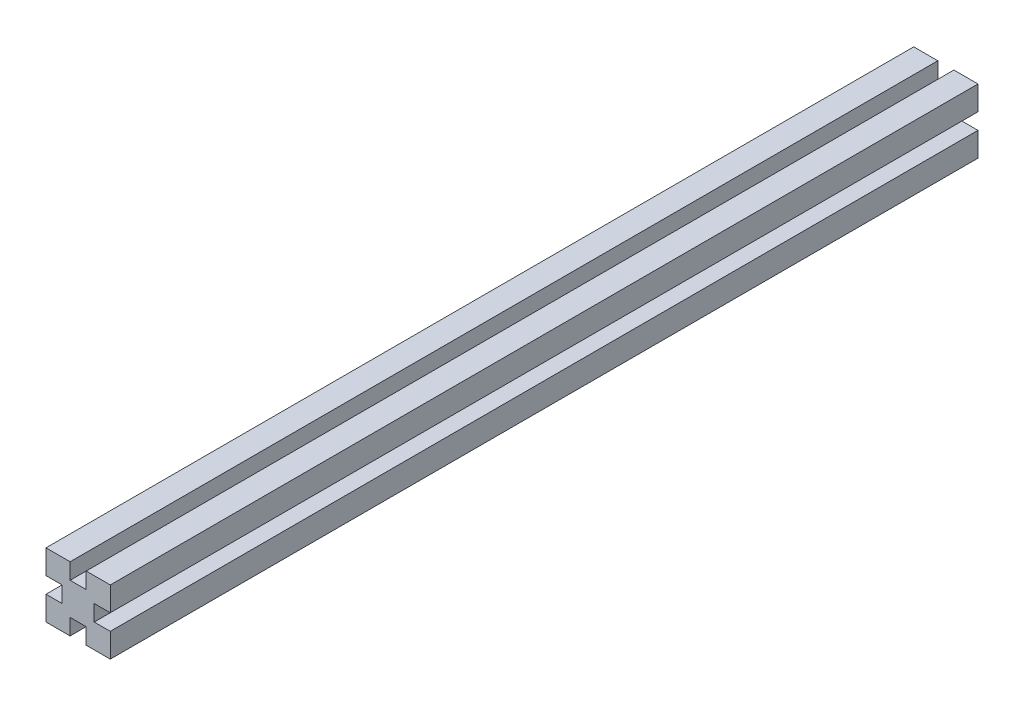
ISO-10303-21;
HEADER;
FILE_DESCRIPTION(('STEP AP214'),'2;1');
FILE_NAME('part.step','',(''),(''),'','','');
FILE_SCHEMA(('AUTOMOTIVE_DESIGN { 1 0 10303 214 1 1 1 1 }'));
ENDSEC;
DATA;
#1=APPLICATION_CONTEXT('core data for automotive mechanical design processes');
#2=APPLICATION_PROTOCOL_DEFINITION('international standard','automotive_design',2000,#1);
#3=PRODUCT_CONTEXT('',#1,'mechanical');
#4=PRODUCT('Part','Part','',(#3));
#5=PRODUCT_RELATED_PRODUCT_CATEGORY('part','',(#4));
#6=PRODUCT_DEFINITION_FORMATION('','',#4);
#7=PRODUCT_DEFINITION_CONTEXT('part definition',#1,'design');
#8=PRODUCT_DEFINITION('design','',#6,#7);
#9=PRODUCT_DEFINITION_SHAPE('','',#8);
#10=(LENGTH_UNIT() NAMED_UNIT(*) SI_UNIT(.MILLI.,.METRE.));
#11=(NAMED_UNIT(*) PLANE_ANGLE_UNIT() SI_UNIT($,.RADIAN.));
#12=(NAMED_UNIT(*) SI_UNIT($,.STERADIAN.) SOLID_ANGLE_UNIT());
#13=UNCERTAINTY_MEASURE_WITH_UNIT(LENGTH_MEASURE(1.E-05),#10,'distance_accuracy_value','');
#14=(GEOMETRIC_REPRESENTATION_CONTEXT(3) GLOBAL_UNCERTAINTY_ASSIGNED_CONTEXT((#13)) GLOBAL_UNIT_ASSIGNED_CONTEXT((#10,
#11,#12)) REPRESENTATION_CONTEXT('',''));
#15=CARTESIAN_POINT('',(0.,0.,0.));
#16=DIRECTION('',(0.,0.,1.));
#17=DIRECTION('',(1.,0.,0.));
#18=AXIS2_PLACEMENT_3D('',#15,#16,#17);
#19=CARTESIAN_POINT('',(0.,0.,-270.));
#20=DIRECTION('',(0.,0.,1.));
#21=DIRECTION('',(1.,0.,0.));
#22=AXIS2_PLACEMENT_3D('',#19,#20,#21);
#23=PLANE('',#22);
#24=DIRECTION('',(-1.,0.,0.));
#25=VECTOR('',#24,1.);
#26=CARTESIAN_POINT('',(0.,-2.5,-270.));
#27=LINE('',#26,#25);
#28=CARTESIAN_POINT('',(10.,-2.50000000000004,-270.));
#29=VERTEX_POINT('',#28);
#30=CARTESIAN_POINT('',(4.99999999999999,-2.50000000000002,-270.));
#31=VERTEX_POINT('',#30);
#32=EDGE_CURVE('E181',#29,#31,#27,.T.);
#33=ORIENTED_EDGE('',*,*,#32,.F.);
#34=DIRECTION('',(0.,-1.,0.));
#35=VECTOR('',#34,1.);
#36=CARTESIAN_POINT('',(10.,0.,-270.));
#37=LINE('',#36,#35);
#38=CARTESIAN_POINT('',(10.,-10.,-270.));
#39=VERTEX_POINT('',#38);
#40=EDGE_CURVE('E279',#29,#39,#37,.T.);
#41=ORIENTED_EDGE('',*,*,#40,.T.);
#42=DIRECTION('',(1.,0.,0.));
#43=VECTOR('',#42,1.);
#44=CARTESIAN_POINT('',(0.,-10.,-270.));
#45=LINE('',#44,#43);
#46=CARTESIAN_POINT('',(2.5,-10.,-270.));
#47=VERTEX_POINT('',#46);
#48=EDGE_CURVE('E275',#47,#39,#45,.T.);
#49=ORIENTED_EDGE('',*,*,#48,.F.);
#50=DIRECTION('',(0.,1.,0.));
#51=VECTOR('',#50,1.);
#52=CARTESIAN_POINT('',(2.5,0.,-270.));
#53=LINE('',#52,#51);
#54=CARTESIAN_POINT('',(2.5,-5.,-270.));
#55=VERTEX_POINT('',#54);
#56=EDGE_CURVE('E60',#47,#55,#53,.T.);
#57=ORIENTED_EDGE('',*,*,#56,.T.);
#58=DIRECTION('',(-1.,0.,0.));
#59=VECTOR('',#58,1.);
#60=CARTESIAN_POINT('',(0.,-5.,-270.));
#61=LINE('',#60,#59);
#62=CARTESIAN_POINT('',(-2.5,-5.,-270.));
#63=VERTEX_POINT('',#62);
#64=EDGE_CURVE('E241',#55,#63,#61,.T.);
#65=ORIENTED_EDGE('',*,*,#64,.T.);
#66=DIRECTION('',(0.,1.,0.));
#67=VECTOR('',#66,1.);
#68=CARTESIAN_POINT('',(-2.5,0.,-270.));
#69=LINE('',#68,#67);
#70=CARTESIAN_POINT('',(-2.5,-10.,-270.));
#71=VERTEX_POINT('',#70);
#72=EDGE_CURVE('E234',#71,#63,#69,.T.);
#73=ORIENTED_EDGE('',*,*,#72,.F.);
#74=CARTESIAN_POINT('',(-10.,-10.,-270.));
#75=VERTEX_POINT('',#74);
#76=EDGE_CURVE('E276',#75,#71,#45,.T.);
#77=ORIENTED_EDGE('',*,*,#76,.F.);
#78=DIRECTION('',(0.,-1.,0.));
#79=VECTOR('',#78,1.);
#80=CARTESIAN_POINT('',(-10.,0.,-270.));
#81=LINE('',#80,#79);
#82=CARTESIAN_POINT('',(-10.,-2.49999999999989,-270.));
#83=VERTEX_POINT('',#82);
#84=EDGE_CURVE('E270',#83,#75,#81,.T.);
#85=ORIENTED_EDGE('',*,*,#84,.F.);
#86=DIRECTION('',(1.,0.,0.));
#87=VECTOR('',#86,1.);
#88=CARTESIAN_POINT('',(0.,-2.5,-270.));
#89=LINE('',#88,#87);
#90=CARTESIAN_POINT('',(-5.00000000000002,-2.49999999999995,-270.));
#91=VERTEX_POINT('',#90);
#92=EDGE_CURVE('E184',#83,#91,#89,.T.);
#93=ORIENTED_EDGE('',*,*,#92,.T.);
#94=DIRECTION('',(0.,1.,0.));
#95=VECTOR('',#94,1.);
#96=CARTESIAN_POINT('',(-5.,0.,-270.));
#97=LINE('',#96,#95);
#98=CARTESIAN_POINT('',(-4.99999999999997,2.50000000000005,-270.));
#99=VERTEX_POINT('',#98);
#100=EDGE_CURVE('E238',#91,#99,#97,.T.);
#101=ORIENTED_EDGE('',*,*,#100,.T.);
#102=DIRECTION('',(1.,0.,0.));
#103=VECTOR('',#102,1.);
#104=CARTESIAN_POINT('',(0.,2.5,-270.));
#105=LINE('',#104,#103);
#106=CARTESIAN_POINT('',(-10.,2.50000000000011,-270.));
#107=VERTEX_POINT('',#106);
#108=EDGE_CURVE('E231',#107,#99,#105,.T.);
#109=ORIENTED_EDGE('',*,*,#108,.F.);
#110=CARTESIAN_POINT('',(-10.,10.,-270.));
#111=VERTEX_POINT('',#110);
#112=EDGE_CURVE('E272',#111,#107,#81,.T.);
#113=ORIENTED_EDGE('',*,*,#112,.F.);
#114=DIRECTION('',(1.,0.,0.));
#115=VECTOR('',#114,1.);
#116=CARTESIAN_POINT('',(0.,10.,-270.));
#117=LINE('',#116,#115);
#118=CARTESIAN_POINT('',(-2.5,10.,-270.));
#119=VERTEX_POINT('',#118);
#120=EDGE_CURVE('E267',#111,#119,#117,.T.);
#121=ORIENTED_EDGE('',*,*,#120,.T.);
#122=DIRECTION('',(0.,-1.,0.));
#123=VECTOR('',#122,1.);
#124=CARTESIAN_POINT('',(-2.5,0.,-270.));
#125=LINE('',#124,#123);
#126=CARTESIAN_POINT('',(-2.5,5.,-270.));
#127=VERTEX_POINT('',#126);
#128=EDGE_CURVE('E253',#119,#127,#125,.T.);
#129=ORIENTED_EDGE('',*,*,#128,.T.);
#130=DIRECTION('',(1.,0.,0.));
#131=VECTOR('',#130,1.);
#132=CARTESIAN_POINT('',(0.,5.,-270.));
#133=LINE('',#132,#131);
#134=CARTESIAN_POINT('',(2.5,5.,-270.));
#135=VERTEX_POINT('',#134);
#136=EDGE_CURVE('E259',#127,#135,#133,.T.);
#137=ORIENTED_EDGE('',*,*,#136,.T.);
#138=DIRECTION('',(0.,-1.,0.));
#139=VECTOR('',#138,1.);
#140=CARTESIAN_POINT('',(2.5,0.,-270.));
#141=LINE('',#140,#139);
#142=CARTESIAN_POINT('',(2.5,10.,-270.));
#143=VERTEX_POINT('',#142);
#144=EDGE_CURVE('E262',#143,#135,#141,.T.);
#145=ORIENTED_EDGE('',*,*,#144,.F.);
#146=CARTESIAN_POINT('',(10.,10.,-270.));
#147=VERTEX_POINT('',#146);
#148=EDGE_CURVE('E271',#143,#147,#117,.T.);
#149=ORIENTED_EDGE('',*,*,#148,.T.);
#150=CARTESIAN_POINT('',(10.,2.49999999999996,-270.));
#151=VERTEX_POINT('',#150);
#152=EDGE_CURVE('E280',#147,#151,#37,.T.);
#153=ORIENTED_EDGE('',*,*,#152,.T.);
#154=DIRECTION('',(-1.,0.,0.));
#155=VECTOR('',#154,1.);
#156=CARTESIAN_POINT('',(0.,2.5,-270.));
#157=LINE('',#156,#155);
#158=CARTESIAN_POINT('',(5.00000000000001,2.49999999999998,-270.));
#159=VERTEX_POINT('',#158);
#160=EDGE_CURVE('E52',#151,#159,#157,.T.);
#161=ORIENTED_EDGE('',*,*,#160,.T.);
#162=DIRECTION('',(0.,-1.,0.));
#163=VECTOR('',#162,1.);
#164=CARTESIAN_POINT('',(5.,0.,-270.));
#165=LINE('',#164,#163);
#166=EDGE_CURVE('E244',#159,#31,#165,.T.);
#167=ORIENTED_EDGE('',*,*,#166,.T.);
#168=EDGE_LOOP('',(#33,#41,#49,#57,#65,#73,#77,#85,#93,#101,#109,#113,#121,#129,#137,#145,#149,
#153,#161,#167));
#169=FACE_BOUND('',#168,.T.);
#170=ADVANCED_FACE('F37',(#169),#23,.F.);
#171=CARTESIAN_POINT('',(0.,0.,0.));
#172=DIRECTION('',(0.,0.,1.));
#173=DIRECTION('',(1.,0.,0.));
#174=AXIS2_PLACEMENT_3D('',#171,#172,#173);
#175=PLANE('',#174);
#176=DIRECTION('',(0.,-1.,0.));
#177=VECTOR('',#176,1.);
#178=CARTESIAN_POINT('',(10.,0.,0.));
#179=LINE('',#178,#177);
#180=CARTESIAN_POINT('',(10.,-2.50000000000004,0.));
#181=VERTEX_POINT('',#180);
#182=CARTESIAN_POINT('',(10.,-10.,0.));
#183=VERTEX_POINT('',#182);
#184=EDGE_CURVE('E198',#181,#183,#179,.T.);
#185=ORIENTED_EDGE('',*,*,#184,.F.);
#186=DIRECTION('',(-1.,0.,0.));
#187=VECTOR('',#186,1.);
#188=CARTESIAN_POINT('',(15.,-2.50000000000005,0.));
#189=LINE('',#188,#187);
#190=CARTESIAN_POINT('',(4.99999999999999,-2.50000000000002,0.));
#191=VERTEX_POINT('',#190);
#192=EDGE_CURVE('E178',#181,#191,#189,.T.);
#193=ORIENTED_EDGE('',*,*,#192,.T.);
#194=DIRECTION('',(0.,-1.,0.));
#195=VECTOR('',#194,1.);
#196=CARTESIAN_POINT('',(5.00000000000001,2.49999999999998,0.));
#197=LINE('',#196,#195);
#198=CARTESIAN_POINT('',(5.00000000000001,2.49999999999998,0.));
#199=VERTEX_POINT('',#198);
#200=EDGE_CURVE('E188',#199,#191,#197,.T.);
#201=ORIENTED_EDGE('',*,*,#200,.F.);
#202=DIRECTION('',(-1.,0.,0.));
#203=VECTOR('',#202,1.);
#204=CARTESIAN_POINT('',(15.,2.49999999999995,0.));
#205=LINE('',#204,#203);
#206=CARTESIAN_POINT('',(10.,2.49999999999996,0.));
#207=VERTEX_POINT('',#206);
#208=EDGE_CURVE('E193',#207,#199,#205,.T.);
#209=ORIENTED_EDGE('',*,*,#208,.F.);
#210=CARTESIAN_POINT('',(10.,10.,0.));
#211=VERTEX_POINT('',#210);
#212=EDGE_CURVE('E295',#211,#207,#179,.T.);
#213=ORIENTED_EDGE('',*,*,#212,.F.);
#214=DIRECTION('',(1.,0.,0.));
#215=VECTOR('',#214,1.);
#216=CARTESIAN_POINT('',(0.,10.,0.));
#217=LINE('',#216,#215);
#218=CARTESIAN_POINT('',(2.5,10.,0.));
#219=VERTEX_POINT('',#218);
#220=EDGE_CURVE('E266',#219,#211,#217,.T.);
#221=ORIENTED_EDGE('',*,*,#220,.F.);
#222=DIRECTION('',(0.,-1.,0.));
#223=VECTOR('',#222,1.);
#224=CARTESIAN_POINT('',(2.5,0.,0.));
#225=LINE('',#224,#223);
#226=CARTESIAN_POINT('',(2.5,5.,0.));
#227=VERTEX_POINT('',#226);
#228=EDGE_CURVE('E311',#219,#227,#225,.T.);
#229=ORIENTED_EDGE('',*,*,#228,.T.);
#230=DIRECTION('',(1.,0.,0.));
#231=VECTOR('',#230,1.);
#232=CARTESIAN_POINT('',(-2.5,5.,0.));
#233=LINE('',#232,#231);
#234=CARTESIAN_POINT('',(-2.5,5.,0.));
#235=VERTEX_POINT('',#234);
#236=EDGE_CURVE('E246',#235,#227,#233,.T.);
#237=ORIENTED_EDGE('',*,*,#236,.F.);
#238=DIRECTION('',(0.,-1.,0.));
#239=VECTOR('',#238,1.);
#240=CARTESIAN_POINT('',(-2.5,0.,0.));
#241=LINE('',#240,#239);
#242=CARTESIAN_POINT('',(-2.5,10.,0.));
#243=VERTEX_POINT('',#242);
#244=EDGE_CURVE('E301',#243,#235,#241,.T.);
#245=ORIENTED_EDGE('',*,*,#244,.F.);
#246=CARTESIAN_POINT('',(-10.,10.,0.));
#247=VERTEX_POINT('',#246);
#248=EDGE_CURVE('E284',#247,#243,#217,.T.);
#249=ORIENTED_EDGE('',*,*,#248,.F.);
#250=DIRECTION('',(0.,-1.,0.));
#251=VECTOR('',#250,1.);
#252=CARTESIAN_POINT('',(-10.,0.,0.));
#253=LINE('',#252,#251);
#254=CARTESIAN_POINT('',(-10.,2.50000000000011,0.));
#255=VERTEX_POINT('',#254);
#256=EDGE_CURVE('E288',#247,#255,#253,.T.);
#257=ORIENTED_EDGE('',*,*,#256,.T.);
#258=DIRECTION('',(1.,0.,0.));
#259=VECTOR('',#258,1.);
#260=CARTESIAN_POINT('',(-15.,2.50000000000016,0.));
#261=LINE('',#260,#259);
#262=CARTESIAN_POINT('',(-4.99999999999997,2.50000000000005,0.));
#263=VERTEX_POINT('',#262);
#264=EDGE_CURVE('E217',#255,#263,#261,.T.);
#265=ORIENTED_EDGE('',*,*,#264,.T.);
#266=DIRECTION('',(0.,1.,0.));
#267=VECTOR('',#266,1.);
#268=CARTESIAN_POINT('',(-5.00000000000002,-2.49999999999995,0.));
#269=LINE('',#268,#267);
#270=CARTESIAN_POINT('',(-5.00000000000002,-2.49999999999995,0.));
#271=VERTEX_POINT('',#270);
#272=EDGE_CURVE('E220',#271,#263,#269,.T.);
#273=ORIENTED_EDGE('',*,*,#272,.F.);
#274=DIRECTION('',(1.,0.,0.));
#275=VECTOR('',#274,1.);
#276=CARTESIAN_POINT('',(-15.,-2.49999999999984,0.));
#277=LINE('',#276,#275);
#278=CARTESIAN_POINT('',(-10.,-2.49999999999989,0.));
#279=VERTEX_POINT('',#278);
#280=EDGE_CURVE('E223',#279,#271,#277,.T.);
#281=ORIENTED_EDGE('',*,*,#280,.F.);
#282=CARTESIAN_POINT('',(-10.,-10.,0.));
#283=VERTEX_POINT('',#282);
#284=EDGE_CURVE('E287',#279,#283,#253,.T.);
#285=ORIENTED_EDGE('',*,*,#284,.T.);
#286=DIRECTION('',(1.,0.,0.));
#287=VECTOR('',#286,1.);
#288=CARTESIAN_POINT('',(0.,-10.,0.));
#289=LINE('',#288,#287);
#290=CARTESIAN_POINT('',(-2.5,-10.,0.));
#291=VERTEX_POINT('',#290);
#292=EDGE_CURVE('E292',#283,#291,#289,.T.);
#293=ORIENTED_EDGE('',*,*,#292,.T.);
#294=DIRECTION('',(0.,1.,0.));
#295=VECTOR('',#294,1.);
#296=CARTESIAN_POINT('',(-2.5,-15.,0.));
#297=LINE('',#296,#295);
#298=CARTESIAN_POINT('',(-2.5,-5.,0.));
#299=VERTEX_POINT('',#298);
#300=EDGE_CURVE('E206',#291,#299,#297,.T.);
#301=ORIENTED_EDGE('',*,*,#300,.T.);
#302=DIRECTION('',(-1.,0.,0.));
#303=VECTOR('',#302,1.);
#304=CARTESIAN_POINT('',(2.5,-5.,0.));
#305=LINE('',#304,#303);
#306=CARTESIAN_POINT('',(2.5,-5.,0.));
#307=VERTEX_POINT('',#306);
#308=EDGE_CURVE('E209',#307,#299,#305,.T.);
#309=ORIENTED_EDGE('',*,*,#308,.F.);
#310=DIRECTION('',(0.,1.,0.));
#311=VECTOR('',#310,1.);
#312=CARTESIAN_POINT('',(2.5,-15.,0.));
#313=LINE('',#312,#311);
#314=CARTESIAN_POINT('',(2.5,-10.,0.));
#315=VERTEX_POINT('',#314);
#316=EDGE_CURVE('E213',#315,#307,#313,.T.);
#317=ORIENTED_EDGE('',*,*,#316,.F.);
#318=EDGE_CURVE('E291',#315,#183,#289,.T.);
#319=ORIENTED_EDGE('',*,*,#318,.T.);
#320=EDGE_LOOP('',(#185,#193,#201,#209,#213,#221,#229,#237,#245,#249,#257,#265,#273,#281,#285,
#293,#301,#309,#317,#319));
#321=FACE_BOUND('',#320,.T.);
#322=ADVANCED_FACE('F196',(#321),#175,.T.);
#323=CARTESIAN_POINT('',(10.,0.,-270.));
#324=DIRECTION('',(-1.,0.,0.));
#325=DIRECTION('',(0.,0.,1.));
#326=AXIS2_PLACEMENT_3D('',#323,#324,#325);
#327=PLANE('',#326);
#328=DIRECTION('',(0.,0.,-1.));
#329=VECTOR('',#328,1.);
#330=CARTESIAN_POINT('',(10.,-2.50000000000004,-270.));
#331=LINE('',#330,#329);
#332=EDGE_CURVE('E11',#181,#29,#331,.T.);
#333=ORIENTED_EDGE('',*,*,#332,.F.);
#334=ORIENTED_EDGE('',*,*,#184,.T.);
#335=DIRECTION('',(0.,0.,1.));
#336=VECTOR('',#335,1.);
#337=CARTESIAN_POINT('',(10.,-10.,-270.));
#338=LINE('',#337,#336);
#339=EDGE_CURVE('E302',#39,#183,#338,.T.);
#340=ORIENTED_EDGE('',*,*,#339,.F.);
#341=ORIENTED_EDGE('',*,*,#40,.F.);
#342=EDGE_LOOP('',(#333,#334,#340,#341));
#343=FACE_BOUND('',#342,.T.);
#344=ADVANCED_FACE('F348',(#343),#327,.F.);
#345=CARTESIAN_POINT('',(0.,-10.,-270.));
#346=DIRECTION('',(0.,-1.,0.));
#347=DIRECTION('',(0.,0.,-1.));
#348=AXIS2_PLACEMENT_3D('',#345,#346,#347);
#349=PLANE('',#348);
#350=ORIENTED_EDGE('',*,*,#76,.T.);
#351=DIRECTION('',(0.,0.,1.));
#352=VECTOR('',#351,1.);
#353=CARTESIAN_POINT('',(-2.5,-10.,-270.));
#354=LINE('',#353,#352);
#355=EDGE_CURVE('E321',#71,#291,#354,.T.);
#356=ORIENTED_EDGE('',*,*,#355,.T.);
#357=ORIENTED_EDGE('',*,*,#292,.F.);
#358=DIRECTION('',(0.,0.,1.));
#359=VECTOR('',#358,1.);
#360=CARTESIAN_POINT('',(-10.,-10.,-270.));
#361=LINE('',#360,#359);
#362=EDGE_CURVE('E305',#75,#283,#361,.T.);
#363=ORIENTED_EDGE('',*,*,#362,.F.);
#364=EDGE_LOOP('',(#350,#356,#357,#363));
#365=FACE_BOUND('',#364,.T.);
#366=ADVANCED_FACE('F360',(#365),#349,.T.);
#367=CARTESIAN_POINT('',(-10.,0.,-270.));
#368=DIRECTION('',(-1.,0.,0.));
#369=DIRECTION('',(0.,-1.,0.));
#370=AXIS2_PLACEMENT_3D('',#367,#368,#369);
#371=PLANE('',#370);
#372=ORIENTED_EDGE('',*,*,#112,.T.);
#373=DIRECTION('',(0.,0.,1.));
#374=VECTOR('',#373,1.);
#375=CARTESIAN_POINT('',(-10.,2.50000000000011,-270.));
#376=LINE('',#375,#374);
#377=EDGE_CURVE('E316',#107,#255,#376,.T.);
#378=ORIENTED_EDGE('',*,*,#377,.T.);
#379=ORIENTED_EDGE('',*,*,#256,.F.);
#380=DIRECTION('',(0.,0.,1.));
#381=VECTOR('',#380,1.);
#382=CARTESIAN_POINT('',(-10.,10.,-270.));
#383=LINE('',#382,#381);
#384=EDGE_CURVE('E283',#111,#247,#383,.T.);
#385=ORIENTED_EDGE('',*,*,#384,.F.);
#386=EDGE_LOOP('',(#372,#378,#379,#385));
#387=FACE_BOUND('',#386,.T.);
#388=ADVANCED_FACE('F363',(#387),#371,.T.);
#389=CARTESIAN_POINT('',(0.,10.,-270.));
#390=DIRECTION('',(0.,-1.,0.));
#391=DIRECTION('',(0.,0.,-1.));
#392=AXIS2_PLACEMENT_3D('',#389,#390,#391);
#393=PLANE('',#392);
#394=DIRECTION('',(0.,0.,-1.));
#395=VECTOR('',#394,1.);
#396=CARTESIAN_POINT('',(2.5,10.,-270.));
#397=LINE('',#396,#395);
#398=EDGE_CURVE('E264',#219,#143,#397,.T.);
#399=ORIENTED_EDGE('',*,*,#398,.F.);
#400=ORIENTED_EDGE('',*,*,#220,.T.);
#401=DIRECTION('',(0.,0.,1.));
#402=VECTOR('',#401,1.);
#403=CARTESIAN_POINT('',(10.,10.,-270.));
#404=LINE('',#403,#402);
#405=EDGE_CURVE('E298',#147,#211,#404,.T.);
#406=ORIENTED_EDGE('',*,*,#405,.F.);
#407=ORIENTED_EDGE('',*,*,#148,.F.);
#408=EDGE_LOOP('',(#399,#400,#406,#407));
#409=FACE_BOUND('',#408,.T.);
#410=ADVANCED_FACE('F333',(#409),#393,.F.);
#411=ORIENTED_EDGE('',*,*,#248,.T.);
#412=DIRECTION('',(0.,0.,-1.));
#413=VECTOR('',#412,1.);
#414=CARTESIAN_POINT('',(-2.5,10.,-270.));
#415=LINE('',#414,#413);
#416=EDGE_CURVE('E256',#243,#119,#415,.T.);
#417=ORIENTED_EDGE('',*,*,#416,.T.);
#418=ORIENTED_EDGE('',*,*,#120,.F.);
#419=ORIENTED_EDGE('',*,*,#384,.T.);
#420=EDGE_LOOP('',(#411,#417,#418,#419));
#421=FACE_BOUND('',#420,.T.);
#422=ADVANCED_FACE('F39',(#421),#393,.F.);
#423=ORIENTED_EDGE('',*,*,#212,.T.);
#424=DIRECTION('',(0.,0.,-1.));
#425=VECTOR('',#424,1.);
#426=CARTESIAN_POINT('',(10.,2.49999999999996,-270.));
#427=LINE('',#426,#425);
#428=EDGE_CURVE('E45',#207,#151,#427,.T.);
#429=ORIENTED_EDGE('',*,*,#428,.T.);
#430=ORIENTED_EDGE('',*,*,#152,.F.);
#431=ORIENTED_EDGE('',*,*,#405,.T.);
#432=EDGE_LOOP('',(#423,#429,#430,#431));
#433=FACE_BOUND('',#432,.T.);
#434=ADVANCED_FACE('F325',(#433),#327,.F.);
#435=DIRECTION('',(0.,0.,1.));
#436=VECTOR('',#435,1.);
#437=CARTESIAN_POINT('',(2.5,-10.,-270.));
#438=LINE('',#437,#436);
#439=EDGE_CURVE('E319',#47,#315,#438,.T.);
#440=ORIENTED_EDGE('',*,*,#439,.F.);
#441=ORIENTED_EDGE('',*,*,#48,.T.);
#442=ORIENTED_EDGE('',*,*,#339,.T.);
#443=ORIENTED_EDGE('',*,*,#318,.F.);
#444=EDGE_LOOP('',(#440,#441,#442,#443));
#445=FACE_BOUND('',#444,.T.);
#446=ADVANCED_FACE('F356',(#445),#349,.T.);
#447=DIRECTION('',(0.,0.,1.));
#448=VECTOR('',#447,1.);
#449=CARTESIAN_POINT('',(-10.,-2.49999999999989,-270.));
#450=LINE('',#449,#448);
#451=EDGE_CURVE('E314',#83,#279,#450,.T.);
#452=ORIENTED_EDGE('',*,*,#451,.F.);
#453=ORIENTED_EDGE('',*,*,#84,.T.);
#454=ORIENTED_EDGE('',*,*,#362,.T.);
#455=ORIENTED_EDGE('',*,*,#284,.F.);
#456=EDGE_LOOP('',(#452,#453,#454,#455));
#457=FACE_BOUND('',#456,.T.);
#458=ADVANCED_FACE('F358',(#457),#371,.T.);
#459=CARTESIAN_POINT('',(2.5,15.,-645.));
#460=DIRECTION('',(-1.,0.,0.));
#461=DIRECTION('',(0.,-1.,0.));
#462=AXIS2_PLACEMENT_3D('',#459,#460,#461);
#463=PLANE('',#462);
#464=ORIENTED_EDGE('',*,*,#398,.T.);
#465=ORIENTED_EDGE('',*,*,#144,.T.);
#466=DIRECTION('',(0.,0.,1.));
#467=VECTOR('',#466,1.);
#468=CARTESIAN_POINT('',(2.5,5.,-645.));
#469=LINE('',#468,#467);
#470=EDGE_CURVE('E251',#135,#227,#469,.T.);
#471=ORIENTED_EDGE('',*,*,#470,.T.);
#472=ORIENTED_EDGE('',*,*,#228,.F.);
#473=EDGE_LOOP('',(#464,#465,#471,#472));
#474=FACE_BOUND('',#473,.T.);
#475=ADVANCED_FACE('F351',(#474),#463,.T.);
#476=CARTESIAN_POINT('',(-2.5,5.,-645.));
#477=DIRECTION('',(0.,-1.,0.));
#478=DIRECTION('',(0.,0.,-1.));
#479=AXIS2_PLACEMENT_3D('',#476,#477,#478);
#480=PLANE('',#479);
#481=DIRECTION('',(0.,0.,1.));
#482=VECTOR('',#481,1.);
#483=CARTESIAN_POINT('',(-2.5,5.,-645.));
#484=LINE('',#483,#482);
#485=EDGE_CURVE('E249',#127,#235,#484,.T.);
#486=ORIENTED_EDGE('',*,*,#485,.T.);
#487=ORIENTED_EDGE('',*,*,#236,.T.);
#488=ORIENTED_EDGE('',*,*,#470,.F.);
#489=ORIENTED_EDGE('',*,*,#136,.F.);
#490=EDGE_LOOP('',(#486,#487,#488,#489));
#491=FACE_BOUND('',#490,.T.);
#492=ADVANCED_FACE('F367',(#491),#480,.F.);
#493=CARTESIAN_POINT('',(-2.5,15.,-645.));
#494=DIRECTION('',(-1.,0.,0.));
#495=DIRECTION('',(0.,-1.,0.));
#496=AXIS2_PLACEMENT_3D('',#493,#494,#495);
#497=PLANE('',#496);
#498=ORIENTED_EDGE('',*,*,#244,.T.);
#499=ORIENTED_EDGE('',*,*,#485,.F.);
#500=ORIENTED_EDGE('',*,*,#128,.F.);
#501=ORIENTED_EDGE('',*,*,#416,.F.);
#502=EDGE_LOOP('',(#498,#499,#500,#501));
#503=FACE_BOUND('',#502,.T.);
#504=ADVANCED_FACE('F394',(#503),#497,.F.);
#505=CARTESIAN_POINT('',(-5.00000000000002,-2.49999999999995,-645.));
#506=DIRECTION('',(1.,0.,0.));
#507=DIRECTION('',(0.,1.,0.));
#508=AXIS2_PLACEMENT_3D('',#505,#506,#507);
#509=PLANE('',#508);
#510=DIRECTION('',(0.,0.,1.));
#511=VECTOR('',#510,1.);
#512=CARTESIAN_POINT('',(-5.00000000000002,-2.49999999999995,-645.));
#513=LINE('',#512,#511);
#514=EDGE_CURVE('E226',#91,#271,#513,.T.);
#515=ORIENTED_EDGE('',*,*,#514,.T.);
#516=ORIENTED_EDGE('',*,*,#272,.T.);
#517=DIRECTION('',(0.,0.,1.));
#518=VECTOR('',#517,1.);
#519=CARTESIAN_POINT('',(-4.99999999999997,2.50000000000005,-645.));
#520=LINE('',#519,#518);
#521=EDGE_CURVE('E210',#99,#263,#520,.T.);
#522=ORIENTED_EDGE('',*,*,#521,.F.);
#523=ORIENTED_EDGE('',*,*,#100,.F.);
#524=EDGE_LOOP('',(#515,#516,#522,#523));
#525=FACE_BOUND('',#524,.T.);
#526=ADVANCED_FACE('F385',(#525),#509,.F.);
#527=CARTESIAN_POINT('',(-15.,2.50000000000016,-645.));
#528=DIRECTION('',(0.,-1.,0.));
#529=DIRECTION('',(1.,0.,0.));
#530=AXIS2_PLACEMENT_3D('',#527,#528,#529);
#531=PLANE('',#530);
#532=ORIENTED_EDGE('',*,*,#108,.T.);
#533=ORIENTED_EDGE('',*,*,#521,.T.);
#534=ORIENTED_EDGE('',*,*,#264,.F.);
#535=ORIENTED_EDGE('',*,*,#377,.F.);
#536=EDGE_LOOP('',(#532,#533,#534,#535));
#537=FACE_BOUND('',#536,.T.);
#538=ADVANCED_FACE('F383',(#537),#531,.T.);
#539=CARTESIAN_POINT('',(-15.,-2.49999999999984,-645.));
#540=DIRECTION('',(0.,-1.,0.));
#541=DIRECTION('',(1.,0.,0.));
#542=AXIS2_PLACEMENT_3D('',#539,#540,#541);
#543=PLANE('',#542);
#544=ORIENTED_EDGE('',*,*,#451,.T.);
#545=ORIENTED_EDGE('',*,*,#280,.T.);
#546=ORIENTED_EDGE('',*,*,#514,.F.);
#547=ORIENTED_EDGE('',*,*,#92,.F.);
#548=EDGE_LOOP('',(#544,#545,#546,#547));
#549=FACE_BOUND('',#548,.T.);
#550=ADVANCED_FACE('F406',(#549),#543,.F.);
#551=CARTESIAN_POINT('',(2.5,-5.,-645.));
#552=DIRECTION('',(0.,1.,0.));
#553=DIRECTION('',(0.,0.,1.));
#554=AXIS2_PLACEMENT_3D('',#551,#552,#553);
#555=PLANE('',#554);
#556=DIRECTION('',(0.,0.,1.));
#557=VECTOR('',#556,1.);
#558=CARTESIAN_POINT('',(2.5,-5.,-645.));
#559=LINE('',#558,#557);
#560=EDGE_CURVE('E201',#55,#307,#559,.T.);
#561=ORIENTED_EDGE('',*,*,#560,.T.);
#562=ORIENTED_EDGE('',*,*,#308,.T.);
#563=DIRECTION('',(0.,0.,1.));
#564=VECTOR('',#563,1.);
#565=CARTESIAN_POINT('',(-2.5,-5.,-645.));
#566=LINE('',#565,#564);
#567=EDGE_CURVE('E199',#63,#299,#566,.T.);
#568=ORIENTED_EDGE('',*,*,#567,.F.);
#569=ORIENTED_EDGE('',*,*,#64,.F.);
#570=EDGE_LOOP('',(#561,#562,#568,#569));
#571=FACE_BOUND('',#570,.T.);
#572=ADVANCED_FACE('F411',(#571),#555,.F.);
#573=CARTESIAN_POINT('',(-2.5,-15.,-645.));
#574=DIRECTION('',(1.,0.,0.));
#575=DIRECTION('',(0.,1.,0.));
#576=AXIS2_PLACEMENT_3D('',#573,#574,#575);
#577=PLANE('',#576);
#578=ORIENTED_EDGE('',*,*,#72,.T.);
#579=ORIENTED_EDGE('',*,*,#567,.T.);
#580=ORIENTED_EDGE('',*,*,#300,.F.);
#581=ORIENTED_EDGE('',*,*,#355,.F.);
#582=EDGE_LOOP('',(#578,#579,#580,#581));
#583=FACE_BOUND('',#582,.T.);
#584=ADVANCED_FACE('F413',(#583),#577,.T.);
#585=CARTESIAN_POINT('',(2.5,-15.,-645.));
#586=DIRECTION('',(1.,0.,0.));
#587=DIRECTION('',(0.,1.,0.));
#588=AXIS2_PLACEMENT_3D('',#585,#586,#587);
#589=PLANE('',#588);
#590=ORIENTED_EDGE('',*,*,#439,.T.);
#591=ORIENTED_EDGE('',*,*,#316,.T.);
#592=ORIENTED_EDGE('',*,*,#560,.F.);
#593=ORIENTED_EDGE('',*,*,#56,.F.);
#594=EDGE_LOOP('',(#590,#591,#592,#593));
#595=FACE_BOUND('',#594,.T.);
#596=ADVANCED_FACE('F416',(#595),#589,.F.);
#597=CARTESIAN_POINT('',(5.00000000000001,2.49999999999998,-645.));
#598=DIRECTION('',(-1.,0.,0.));
#599=DIRECTION('',(0.,-1.,0.));
#600=AXIS2_PLACEMENT_3D('',#597,#598,#599);
#601=PLANE('',#600);
#602=DIRECTION('',(0.,0.,1.));
#603=VECTOR('',#602,1.);
#604=CARTESIAN_POINT('',(5.00000000000001,2.49999999999998,-645.));
#605=LINE('',#604,#603);
#606=EDGE_CURVE('E185',#159,#199,#605,.T.);
#607=ORIENTED_EDGE('',*,*,#606,.T.);
#608=ORIENTED_EDGE('',*,*,#200,.T.);
#609=DIRECTION('',(0.,0.,1.));
#610=VECTOR('',#609,1.);
#611=CARTESIAN_POINT('',(4.99999999999999,-2.50000000000002,-645.));
#612=LINE('',#611,#610);
#613=EDGE_CURVE('E174',#31,#191,#612,.T.);
#614=ORIENTED_EDGE('',*,*,#613,.F.);
#615=ORIENTED_EDGE('',*,*,#166,.F.);
#616=EDGE_LOOP('',(#607,#608,#614,#615));
#617=FACE_BOUND('',#616,.T.);
#618=ADVANCED_FACE('F189',(#617),#601,.F.);
#619=CARTESIAN_POINT('',(15.,-2.50000000000005,-645.));
#620=DIRECTION('',(0.,1.,0.));
#621=DIRECTION('',(-1.,0.,0.));
#622=AXIS2_PLACEMENT_3D('',#619,#620,#621);
#623=PLANE('',#622);
#624=ORIENTED_EDGE('',*,*,#32,.T.);
#625=ORIENTED_EDGE('',*,*,#613,.T.);
#626=ORIENTED_EDGE('',*,*,#192,.F.);
#627=ORIENTED_EDGE('',*,*,#332,.T.);
#628=EDGE_LOOP('',(#624,#625,#626,#627));
#629=FACE_BOUND('',#628,.T.);
#630=ADVANCED_FACE('F176',(#629),#623,.T.);
#631=CARTESIAN_POINT('',(15.,2.49999999999995,-645.));
#632=DIRECTION('',(0.,1.,0.));
#633=DIRECTION('',(-1.,0.,0.));
#634=AXIS2_PLACEMENT_3D('',#631,#632,#633);
#635=PLANE('',#634);
#636=ORIENTED_EDGE('',*,*,#428,.F.);
#637=ORIENTED_EDGE('',*,*,#208,.T.);
#638=ORIENTED_EDGE('',*,*,#606,.F.);
#639=ORIENTED_EDGE('',*,*,#160,.F.);
#640=EDGE_LOOP('',(#636,#637,#638,#639));
#641=FACE_BOUND('',#640,.T.);
#642=ADVANCED_FACE('F335',(#641),#635,.F.);
#643=CLOSED_SHELL('',(#170,#322,#344,#366,#388,#410,#422,#434,#446,#458,#475,#492,#504,#526,
#538,#550,#572,#584,#596,#618,#630,#642));
#644=MANIFOLD_SOLID_BREP('B2',#643);
#645=ADVANCED_BREP_SHAPE_REPRESENTATION('',(#18,#644),#14);
#646=SHAPE_DEFINITION_REPRESENTATION(#9,#645);
ENDSEC;
END-ISO-10303-21;
